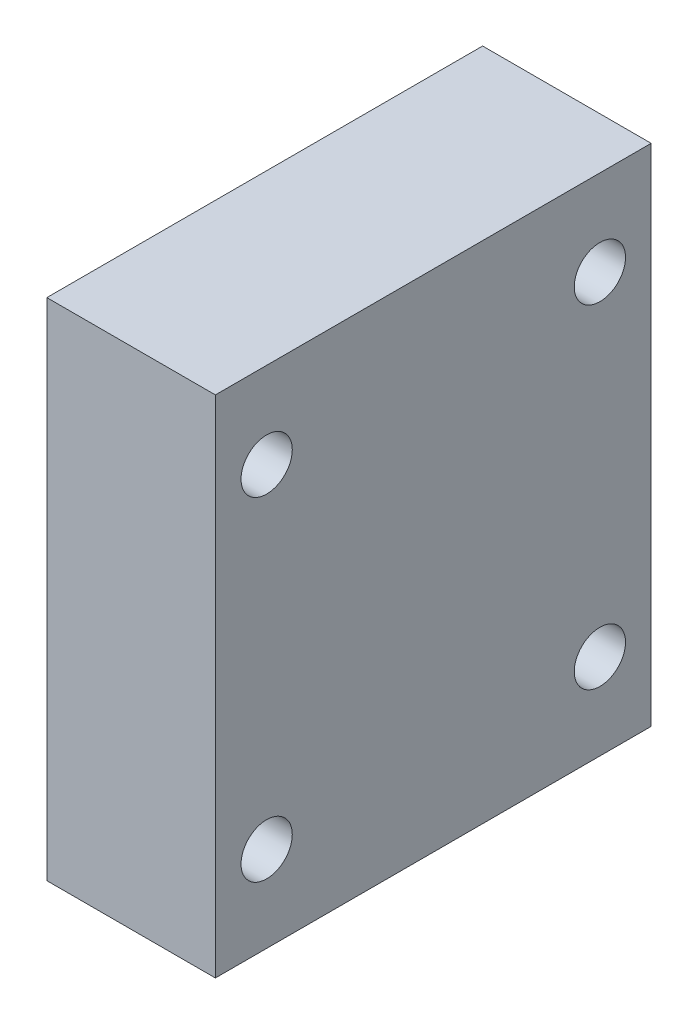
ISO-10303-21;
HEADER;
FILE_DESCRIPTION(('STEP AP214'),'2;1');
FILE_NAME('part.step','',(''),(''),'','','');
FILE_SCHEMA(('AUTOMOTIVE_DESIGN { 1 0 10303 214 1 1 1 1 }'));
ENDSEC;
DATA;
#1=APPLICATION_CONTEXT('core data for automotive mechanical design processes');
#2=APPLICATION_PROTOCOL_DEFINITION('international standard','automotive_design',2000,#1);
#3=PRODUCT_CONTEXT('',#1,'mechanical');
#4=PRODUCT('Part','Part','',(#3));
#5=PRODUCT_RELATED_PRODUCT_CATEGORY('part','',(#4));
#6=PRODUCT_DEFINITION_FORMATION('','',#4);
#7=PRODUCT_DEFINITION_CONTEXT('part definition',#1,'design');
#8=PRODUCT_DEFINITION('design','',#6,#7);
#9=PRODUCT_DEFINITION_SHAPE('','',#8);
#10=(LENGTH_UNIT() NAMED_UNIT(*) SI_UNIT(.MILLI.,.METRE.));
#11=(NAMED_UNIT(*) PLANE_ANGLE_UNIT() SI_UNIT($,.RADIAN.));
#12=(NAMED_UNIT(*) SI_UNIT($,.STERADIAN.) SOLID_ANGLE_UNIT());
#13=UNCERTAINTY_MEASURE_WITH_UNIT(LENGTH_MEASURE(1.E-05),#10,'distance_accuracy_value','');
#14=(GEOMETRIC_REPRESENTATION_CONTEXT(3) GLOBAL_UNCERTAINTY_ASSIGNED_CONTEXT((#13)) GLOBAL_UNIT_ASSIGNED_CONTEXT((#10,
#11,#12)) REPRESENTATION_CONTEXT('',''));
#15=CARTESIAN_POINT('',(0.,0.,0.));
#16=DIRECTION('',(0.,0.,1.));
#17=DIRECTION('',(1.,0.,0.));
#18=AXIS2_PLACEMENT_3D('',#15,#16,#17);
#19=CARTESIAN_POINT('',(13.15,0.,0.));
#20=DIRECTION('',(-1.,0.,0.));
#21=DIRECTION('',(0.,0.,1.));
#22=AXIS2_PLACEMENT_3D('',#19,#20,#21);
#23=PLANE('',#22);
#24=CARTESIAN_POINT('',(13.15,-13.,-13.));
#25=DIRECTION('',(1.,0.,0.));
#26=DIRECTION('',(0.,0.,-1.));
#27=AXIS2_PLACEMENT_3D('',#24,#25,#26);
#28=CIRCLE('',#27,2.);
#29=CARTESIAN_POINT('',(13.15,-13.,-15.));
#30=VERTEX_POINT('',#29);
#31=EDGE_CURVE('E123',#30,#30,#28,.T.);
#32=ORIENTED_EDGE('',*,*,#31,.F.);
#33=EDGE_LOOP('',(#32));
#34=FACE_BOUND('',#33,.T.);
#35=CARTESIAN_POINT('',(13.15,13.,13.));
#36=DIRECTION('',(1.,0.,0.));
#37=DIRECTION('',(0.,0.,-1.));
#38=AXIS2_PLACEMENT_3D('',#35,#36,#37);
#39=CIRCLE('',#38,2.);
#40=CARTESIAN_POINT('',(13.15,13.,11.));
#41=VERTEX_POINT('',#40);
#42=EDGE_CURVE('E102',#41,#41,#39,.T.);
#43=ORIENTED_EDGE('',*,*,#42,.F.);
#44=EDGE_LOOP('',(#43));
#45=FACE_BOUND('',#44,.T.);
#46=DIRECTION('',(0.,1.,0.));
#47=VECTOR('',#46,1.);
#48=CARTESIAN_POINT('',(13.15,-19.7,-17.));
#49=LINE('',#48,#47);
#50=CARTESIAN_POINT('',(13.15,-19.7,-17.));
#51=VERTEX_POINT('',#50);
#52=CARTESIAN_POINT('',(13.15,19.7,-17.));
#53=VERTEX_POINT('',#52);
#54=EDGE_CURVE('E87',#51,#53,#49,.T.);
#55=ORIENTED_EDGE('',*,*,#54,.T.);
#56=DIRECTION('',(0.,0.,1.));
#57=VECTOR('',#56,1.);
#58=CARTESIAN_POINT('',(13.15,19.7,17.));
#59=LINE('',#58,#57);
#60=CARTESIAN_POINT('',(13.15,19.7,17.));
#61=VERTEX_POINT('',#60);
#62=EDGE_CURVE('E82',#53,#61,#59,.T.);
#63=ORIENTED_EDGE('',*,*,#62,.T.);
#64=DIRECTION('',(0.,-1.,0.));
#65=VECTOR('',#64,1.);
#66=CARTESIAN_POINT('',(13.15,-19.7,17.));
#67=LINE('',#66,#65);
#68=CARTESIAN_POINT('',(13.15,-19.7,17.));
#69=VERTEX_POINT('',#68);
#70=EDGE_CURVE('E85',#61,#69,#67,.T.);
#71=ORIENTED_EDGE('',*,*,#70,.T.);
#72=DIRECTION('',(0.,0.,-1.));
#73=VECTOR('',#72,1.);
#74=CARTESIAN_POINT('',(13.15,-19.7,17.));
#75=LINE('',#74,#73);
#76=EDGE_CURVE('E52',#69,#51,#75,.T.);
#77=ORIENTED_EDGE('',*,*,#76,.T.);
#78=EDGE_LOOP('',(#55,#63,#71,#77));
#79=FACE_BOUND('',#78,.T.);
#80=CARTESIAN_POINT('',(13.15,13.,-13.));
#81=DIRECTION('',(1.,0.,0.));
#82=DIRECTION('',(0.,0.,-1.));
#83=AXIS2_PLACEMENT_3D('',#80,#81,#82);
#84=CIRCLE('',#83,2.);
#85=CARTESIAN_POINT('',(13.15,13.,-15.));
#86=VERTEX_POINT('',#85);
#87=EDGE_CURVE('E117',#86,#86,#84,.T.);
#88=ORIENTED_EDGE('',*,*,#87,.F.);
#89=EDGE_LOOP('',(#88));
#90=FACE_BOUND('',#89,.T.);
#91=CARTESIAN_POINT('',(13.15,-13.,13.));
#92=DIRECTION('',(1.,0.,0.));
#93=DIRECTION('',(0.,0.,-1.));
#94=AXIS2_PLACEMENT_3D('',#91,#92,#93);
#95=CIRCLE('',#94,2.);
#96=CARTESIAN_POINT('',(13.15,-13.,11.));
#97=VERTEX_POINT('',#96);
#98=EDGE_CURVE('E129',#97,#97,#95,.T.);
#99=ORIENTED_EDGE('',*,*,#98,.F.);
#100=EDGE_LOOP('',(#99));
#101=FACE_BOUND('',#100,.T.);
#102=ADVANCED_FACE('F35',(#34,#45,#79,#90,#101),#23,.F.);
#103=CARTESIAN_POINT('',(0.,0.,0.));
#104=DIRECTION('',(-1.,0.,0.));
#105=DIRECTION('',(0.,0.,1.));
#106=AXIS2_PLACEMENT_3D('',#103,#104,#105);
#107=PLANE('',#106);
#108=CARTESIAN_POINT('',(0.,-13.,-13.));
#109=DIRECTION('',(1.,0.,0.));
#110=DIRECTION('',(0.,0.,-1.));
#111=AXIS2_PLACEMENT_3D('',#108,#109,#110);
#112=CIRCLE('',#111,2.);
#113=CARTESIAN_POINT('',(0.,-13.,-15.));
#114=VERTEX_POINT('',#113);
#115=EDGE_CURVE('E126',#114,#114,#112,.T.);
#116=ORIENTED_EDGE('',*,*,#115,.T.);
#117=EDGE_LOOP('',(#116));
#118=FACE_BOUND('',#117,.T.);
#119=CARTESIAN_POINT('',(0.,13.,13.));
#120=DIRECTION('',(1.,0.,0.));
#121=DIRECTION('',(0.,0.,-1.));
#122=AXIS2_PLACEMENT_3D('',#119,#120,#121);
#123=CIRCLE('',#122,2.);
#124=CARTESIAN_POINT('',(0.,13.,11.));
#125=VERTEX_POINT('',#124);
#126=EDGE_CURVE('E114',#125,#125,#123,.T.);
#127=ORIENTED_EDGE('',*,*,#126,.T.);
#128=EDGE_LOOP('',(#127));
#129=FACE_BOUND('',#128,.T.);
#130=DIRECTION('',(0.,1.,0.));
#131=VECTOR('',#130,1.);
#132=CARTESIAN_POINT('',(0.,-19.7,-17.));
#133=LINE('',#132,#131);
#134=CARTESIAN_POINT('',(0.,-19.7,-17.));
#135=VERTEX_POINT('',#134);
#136=CARTESIAN_POINT('',(0.,19.7,-17.));
#137=VERTEX_POINT('',#136);
#138=EDGE_CURVE('E99',#135,#137,#133,.T.);
#139=ORIENTED_EDGE('',*,*,#138,.F.);
#140=DIRECTION('',(0.,0.,-1.));
#141=VECTOR('',#140,1.);
#142=CARTESIAN_POINT('',(0.,-19.7,17.));
#143=LINE('',#142,#141);
#144=CARTESIAN_POINT('',(0.,-19.7,17.));
#145=VERTEX_POINT('',#144);
#146=EDGE_CURVE('E75',#145,#135,#143,.T.);
#147=ORIENTED_EDGE('',*,*,#146,.F.);
#148=DIRECTION('',(0.,-1.,0.));
#149=VECTOR('',#148,1.);
#150=CARTESIAN_POINT('',(0.,-19.7,17.));
#151=LINE('',#150,#149);
#152=CARTESIAN_POINT('',(0.,19.7,17.));
#153=VERTEX_POINT('',#152);
#154=EDGE_CURVE('E69',#153,#145,#151,.T.);
#155=ORIENTED_EDGE('',*,*,#154,.F.);
#156=DIRECTION('',(0.,0.,1.));
#157=VECTOR('',#156,1.);
#158=CARTESIAN_POINT('',(0.,19.7,17.));
#159=LINE('',#158,#157);
#160=EDGE_CURVE('E91',#137,#153,#159,.T.);
#161=ORIENTED_EDGE('',*,*,#160,.F.);
#162=EDGE_LOOP('',(#139,#147,#155,#161));
#163=FACE_BOUND('',#162,.T.);
#164=CARTESIAN_POINT('',(0.,13.,-13.));
#165=DIRECTION('',(1.,0.,0.));
#166=DIRECTION('',(0.,0.,-1.));
#167=AXIS2_PLACEMENT_3D('',#164,#165,#166);
#168=CIRCLE('',#167,2.);
#169=CARTESIAN_POINT('',(0.,13.,-15.));
#170=VERTEX_POINT('',#169);
#171=EDGE_CURVE('E120',#170,#170,#168,.T.);
#172=ORIENTED_EDGE('',*,*,#171,.T.);
#173=EDGE_LOOP('',(#172));
#174=FACE_BOUND('',#173,.T.);
#175=CARTESIAN_POINT('',(0.,-13.,13.));
#176=DIRECTION('',(1.,0.,0.));
#177=DIRECTION('',(0.,0.,-1.));
#178=AXIS2_PLACEMENT_3D('',#175,#176,#177);
#179=CIRCLE('',#178,2.);
#180=CARTESIAN_POINT('',(0.,-13.,11.));
#181=VERTEX_POINT('',#180);
#182=EDGE_CURVE('E132',#181,#181,#179,.T.);
#183=ORIENTED_EDGE('',*,*,#182,.T.);
#184=EDGE_LOOP('',(#183));
#185=FACE_BOUND('',#184,.T.);
#186=ADVANCED_FACE('F110',(#118,#129,#163,#174,#185),#107,.T.);
#187=CARTESIAN_POINT('',(13.15,-19.7,-17.));
#188=DIRECTION('',(0.,0.,1.));
#189=DIRECTION('',(0.,-1.,0.));
#190=AXIS2_PLACEMENT_3D('',#187,#188,#189);
#191=PLANE('',#190);
#192=ORIENTED_EDGE('',*,*,#138,.T.);
#193=DIRECTION('',(-1.,0.,0.));
#194=VECTOR('',#193,1.);
#195=CARTESIAN_POINT('',(13.15,19.7,-17.));
#196=LINE('',#195,#194);
#197=EDGE_CURVE('E11',#53,#137,#196,.T.);
#198=ORIENTED_EDGE('',*,*,#197,.F.);
#199=ORIENTED_EDGE('',*,*,#54,.F.);
#200=DIRECTION('',(-1.,0.,0.));
#201=VECTOR('',#200,1.);
#202=CARTESIAN_POINT('',(13.15,-19.7,-17.));
#203=LINE('',#202,#201);
#204=EDGE_CURVE('E95',#51,#135,#203,.T.);
#205=ORIENTED_EDGE('',*,*,#204,.T.);
#206=EDGE_LOOP('',(#192,#198,#199,#205));
#207=FACE_BOUND('',#206,.T.);
#208=ADVANCED_FACE('F37',(#207),#191,.F.);
#209=CARTESIAN_POINT('',(13.15,19.7,17.));
#210=DIRECTION('',(0.,-1.,0.));
#211=DIRECTION('',(0.,0.,-1.));
#212=AXIS2_PLACEMENT_3D('',#209,#210,#211);
#213=PLANE('',#212);
#214=ORIENTED_EDGE('',*,*,#160,.T.);
#215=DIRECTION('',(-1.,0.,0.));
#216=VECTOR('',#215,1.);
#217=CARTESIAN_POINT('',(13.15,19.7,17.));
#218=LINE('',#217,#216);
#219=EDGE_CURVE('E44',#61,#153,#218,.T.);
#220=ORIENTED_EDGE('',*,*,#219,.F.);
#221=ORIENTED_EDGE('',*,*,#62,.F.);
#222=ORIENTED_EDGE('',*,*,#197,.T.);
#223=EDGE_LOOP('',(#214,#220,#221,#222));
#224=FACE_BOUND('',#223,.T.);
#225=ADVANCED_FACE('F90',(#224),#213,.F.);
#226=CARTESIAN_POINT('',(13.15,-19.7,17.));
#227=DIRECTION('',(0.,0.,-1.));
#228=DIRECTION('',(0.,1.,0.));
#229=AXIS2_PLACEMENT_3D('',#226,#227,#228);
#230=PLANE('',#229);
#231=ORIENTED_EDGE('',*,*,#154,.T.);
#232=DIRECTION('',(-1.,0.,0.));
#233=VECTOR('',#232,1.);
#234=CARTESIAN_POINT('',(13.15,-19.7,17.));
#235=LINE('',#234,#233);
#236=EDGE_CURVE('E92',#69,#145,#235,.T.);
#237=ORIENTED_EDGE('',*,*,#236,.F.);
#238=ORIENTED_EDGE('',*,*,#70,.F.);
#239=ORIENTED_EDGE('',*,*,#219,.T.);
#240=EDGE_LOOP('',(#231,#237,#238,#239));
#241=FACE_BOUND('',#240,.T.);
#242=ADVANCED_FACE('F93',(#241),#230,.F.);
#243=CARTESIAN_POINT('',(13.15,-19.7,17.));
#244=DIRECTION('',(0.,1.,0.));
#245=DIRECTION('',(0.,0.,1.));
#246=AXIS2_PLACEMENT_3D('',#243,#244,#245);
#247=PLANE('',#246);
#248=ORIENTED_EDGE('',*,*,#146,.T.);
#249=ORIENTED_EDGE('',*,*,#204,.F.);
#250=ORIENTED_EDGE('',*,*,#76,.F.);
#251=ORIENTED_EDGE('',*,*,#236,.T.);
#252=EDGE_LOOP('',(#248,#249,#250,#251));
#253=FACE_BOUND('',#252,.T.);
#254=ADVANCED_FACE('F107',(#253),#247,.F.);
#255=CARTESIAN_POINT('',(13.15,13.,13.));
#256=DIRECTION('',(-1.,0.,0.));
#257=DIRECTION('',(0.,0.,1.));
#258=AXIS2_PLACEMENT_3D('',#255,#256,#257);
#259=CYLINDRICAL_SURFACE('',#258,2.);
#260=ORIENTED_EDGE('',*,*,#42,.T.);
#261=EDGE_LOOP('',(#260));
#262=FACE_BOUND('',#261,.T.);
#263=ORIENTED_EDGE('',*,*,#126,.F.);
#264=EDGE_LOOP('',(#263));
#265=FACE_BOUND('',#264,.T.);
#266=ADVANCED_FACE('F152',(#262,#265),#259,.F.);
#267=CARTESIAN_POINT('',(13.15,13.,-13.));
#268=DIRECTION('',(-1.,0.,0.));
#269=DIRECTION('',(0.,0.,1.));
#270=AXIS2_PLACEMENT_3D('',#267,#268,#269);
#271=CYLINDRICAL_SURFACE('',#270,2.);
#272=ORIENTED_EDGE('',*,*,#87,.T.);
#273=EDGE_LOOP('',(#272));
#274=FACE_BOUND('',#273,.T.);
#275=ORIENTED_EDGE('',*,*,#171,.F.);
#276=EDGE_LOOP('',(#275));
#277=FACE_BOUND('',#276,.T.);
#278=ADVANCED_FACE('F198',(#274,#277),#271,.F.);
#279=CARTESIAN_POINT('',(13.15,-13.,-13.));
#280=DIRECTION('',(-1.,0.,0.));
#281=DIRECTION('',(0.,0.,1.));
#282=AXIS2_PLACEMENT_3D('',#279,#280,#281);
#283=CYLINDRICAL_SURFACE('',#282,2.);
#284=ORIENTED_EDGE('',*,*,#31,.T.);
#285=EDGE_LOOP('',(#284));
#286=FACE_BOUND('',#285,.T.);
#287=ORIENTED_EDGE('',*,*,#115,.F.);
#288=EDGE_LOOP('',(#287));
#289=FACE_BOUND('',#288,.T.);
#290=ADVANCED_FACE('F206',(#286,#289),#283,.F.);
#291=CARTESIAN_POINT('',(13.15,-13.,13.));
#292=DIRECTION('',(-1.,0.,0.));
#293=DIRECTION('',(0.,0.,1.));
#294=AXIS2_PLACEMENT_3D('',#291,#292,#293);
#295=CYLINDRICAL_SURFACE('',#294,2.);
#296=ORIENTED_EDGE('',*,*,#98,.T.);
#297=EDGE_LOOP('',(#296));
#298=FACE_BOUND('',#297,.T.);
#299=ORIENTED_EDGE('',*,*,#182,.F.);
#300=EDGE_LOOP('',(#299));
#301=FACE_BOUND('',#300,.T.);
#302=ADVANCED_FACE('F138',(#298,#301),#295,.F.);
#303=CLOSED_SHELL('',(#102,#186,#208,#225,#242,#254,#266,#278,#290,#302));
#304=MANIFOLD_SOLID_BREP('B2',#303);
#305=ADVANCED_BREP_SHAPE_REPRESENTATION('',(#18,#304),#14);
#306=SHAPE_DEFINITION_REPRESENTATION(#9,#305);
ENDSEC;
END-ISO-10303-21;
